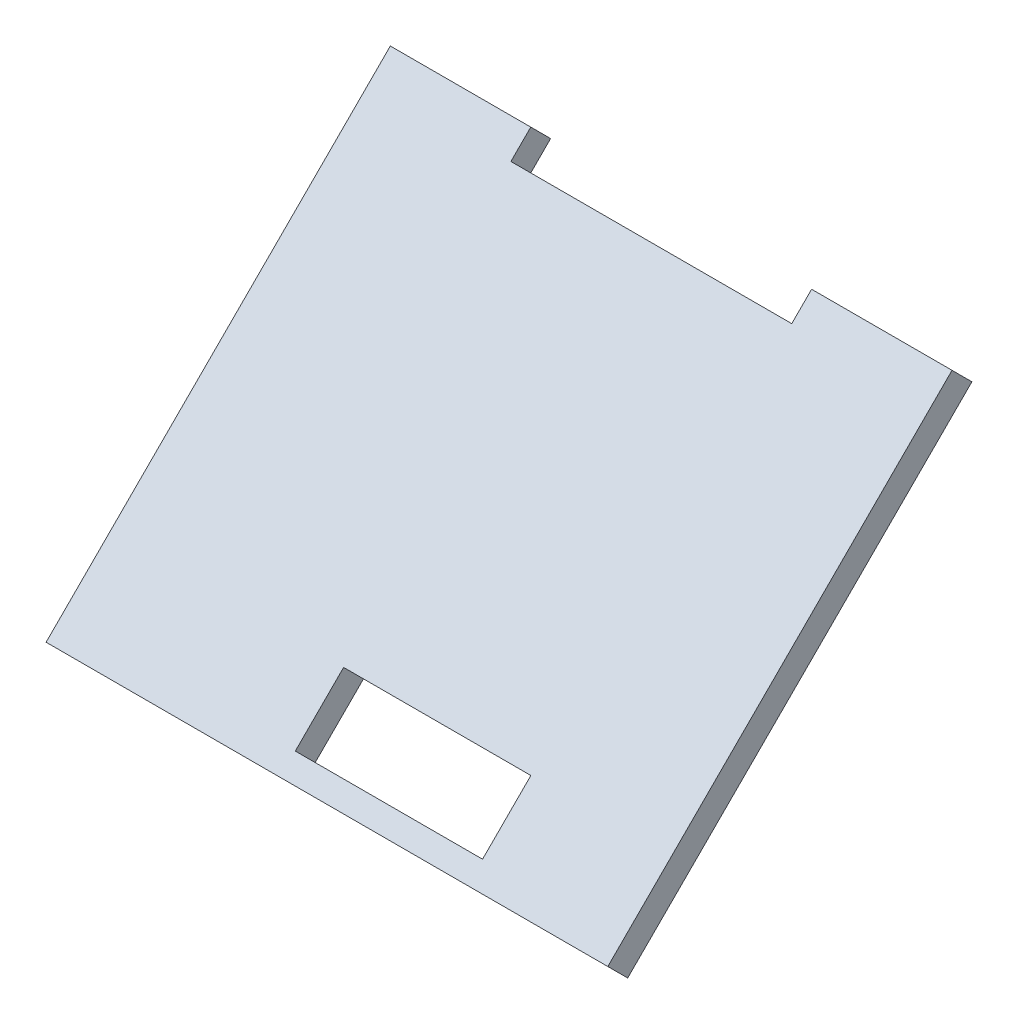
ISO-10303-21;
HEADER;
FILE_DESCRIPTION(('STEP AP214'),'2;1');
FILE_NAME('part.step','',(''),(''),'','','');
FILE_SCHEMA(('AUTOMOTIVE_DESIGN { 1 0 10303 214 1 1 1 1 }'));
ENDSEC;
DATA;
#1=APPLICATION_CONTEXT('core data for automotive mechanical design processes');
#2=APPLICATION_PROTOCOL_DEFINITION('international standard','automotive_design',2000,#1);
#3=PRODUCT_CONTEXT('',#1,'mechanical');
#4=PRODUCT('Part','Part','',(#3));
#5=PRODUCT_RELATED_PRODUCT_CATEGORY('part','',(#4));
#6=PRODUCT_DEFINITION_FORMATION('','',#4);
#7=PRODUCT_DEFINITION_CONTEXT('part definition',#1,'design');
#8=PRODUCT_DEFINITION('design','',#6,#7);
#9=PRODUCT_DEFINITION_SHAPE('','',#8);
#10=(LENGTH_UNIT() NAMED_UNIT(*) SI_UNIT(.MILLI.,.METRE.));
#11=(NAMED_UNIT(*) PLANE_ANGLE_UNIT() SI_UNIT($,.RADIAN.));
#12=(NAMED_UNIT(*) SI_UNIT($,.STERADIAN.) SOLID_ANGLE_UNIT());
#13=UNCERTAINTY_MEASURE_WITH_UNIT(LENGTH_MEASURE(1.E-05),#10,'distance_accuracy_value','');
#14=(GEOMETRIC_REPRESENTATION_CONTEXT(3) GLOBAL_UNCERTAINTY_ASSIGNED_CONTEXT((#13)) GLOBAL_UNIT_ASSIGNED_CONTEXT((#10,
#11,#12)) REPRESENTATION_CONTEXT('',''));
#15=CARTESIAN_POINT('',(0.,0.,0.));
#16=DIRECTION('',(0.,0.,1.));
#17=DIRECTION('',(1.,0.,0.));
#18=AXIS2_PLACEMENT_3D('',#15,#16,#17);
#19=CARTESIAN_POINT('',(0.,72.1213203435599,72.1213203435597));
#20=DIRECTION('',(0.,0.707106781186549,0.707106781186546));
#21=DIRECTION('',(0.,-0.707106781186546,0.707106781186549));
#22=AXIS2_PLACEMENT_3D('',#19,#20,#21);
#23=PLANE('',#22);
#24=DIRECTION('',(0.,-0.707106781186546,0.707106781186549));
#25=VECTOR('',#24,1.);
#26=CARTESIAN_POINT('',(-60.,177.27132034356,-33.0286796564405));
#27=LINE('',#26,#25);
#28=CARTESIAN_POINT('',(-60.,177.27132034356,-33.0286796564405));
#29=VERTEX_POINT('',#28);
#30=CARTESIAN_POINT('',(-60.,140.501767721859,3.74087296526005));
#31=VERTEX_POINT('',#30);
#32=EDGE_CURVE('E160',#29,#31,#27,.T.);
#33=ORIENTED_EDGE('',*,*,#32,.T.);
#34=DIRECTION('',(1.,0.,0.));
#35=VECTOR('',#34,1.);
#36=CARTESIAN_POINT('',(-60.,140.501767721859,3.74087296526005));
#37=LINE('',#36,#35);
#38=CARTESIAN_POINT('',(0.,140.501767721859,3.74087296526005));
#39=VERTEX_POINT('',#38);
#40=EDGE_CURVE('E163',#31,#39,#37,.T.);
#41=ORIENTED_EDGE('',*,*,#40,.T.);
#42=DIRECTION('',(0.,0.707106781186546,-0.707106781186549));
#43=VECTOR('',#42,1.);
#44=CARTESIAN_POINT('',(0.,177.27132034356,-33.0286796564405));
#45=LINE('',#44,#43);
#46=CARTESIAN_POINT('',(0.,177.27132034356,-33.0286796564405));
#47=VERTEX_POINT('',#46);
#48=EDGE_CURVE('E166',#39,#47,#45,.T.);
#49=ORIENTED_EDGE('',*,*,#48,.T.);
#50=DIRECTION('',(-1.,0.,0.));
#51=VECTOR('',#50,1.);
#52=CARTESIAN_POINT('',(-15.,177.27132034356,-33.0286796564405));
#53=LINE('',#52,#51);
#54=CARTESIAN_POINT('',(-15.,177.27132034356,-33.0286796564405));
#55=VERTEX_POINT('',#54);
#56=EDGE_CURVE('E168',#47,#55,#53,.T.);
#57=ORIENTED_EDGE('',*,*,#56,.T.);
#58=DIRECTION('',(0.,-0.707106781186545,0.70710678118655));
#59=VECTOR('',#58,1.);
#60=CARTESIAN_POINT('',(-15.,177.27132034356,-33.0286796564405));
#61=LINE('',#60,#59);
#62=CARTESIAN_POINT('',(-15.,175.15,-30.9073593128808));
#63=VERTEX_POINT('',#62);
#64=EDGE_CURVE('E170',#55,#63,#61,.T.);
#65=ORIENTED_EDGE('',*,*,#64,.T.);
#66=DIRECTION('',(-1.,0.,0.));
#67=VECTOR('',#66,1.);
#68=CARTESIAN_POINT('',(-45.,175.15,-30.9073593128808));
#69=LINE('',#68,#67);
#70=CARTESIAN_POINT('',(-45.,175.15,-30.9073593128808));
#71=VERTEX_POINT('',#70);
#72=EDGE_CURVE('E172',#63,#71,#69,.T.);
#73=ORIENTED_EDGE('',*,*,#72,.T.);
#74=DIRECTION('',(0.,0.707106781186545,-0.70710678118655));
#75=VECTOR('',#74,1.);
#76=CARTESIAN_POINT('',(-45.,177.27132034356,-33.0286796564405));
#77=LINE('',#76,#75);
#78=CARTESIAN_POINT('',(-45.,177.27132034356,-33.0286796564405));
#79=VERTEX_POINT('',#78);
#80=EDGE_CURVE('E174',#71,#79,#77,.T.);
#81=ORIENTED_EDGE('',*,*,#80,.T.);
#82=DIRECTION('',(-1.,0.,0.));
#83=VECTOR('',#82,1.);
#84=CARTESIAN_POINT('',(-60.,177.27132034356,-33.0286796564405));
#85=LINE('',#84,#83);
#86=EDGE_CURVE('E176',#79,#29,#85,.T.);
#87=ORIENTED_EDGE('',*,*,#86,.T.);
#88=EDGE_LOOP('',(#33,#41,#49,#57,#65,#73,#81,#87));
#89=FACE_BOUND('',#88,.T.);
#90=DIRECTION('',(1.,0.,0.));
#91=VECTOR('',#90,1.);
#92=CARTESIAN_POINT('',(-35.,142.12132034356,2.12132034355963));
#93=LINE('',#92,#91);
#94=CARTESIAN_POINT('',(-35.,142.12132034356,2.12132034355963));
#95=VERTEX_POINT('',#94);
#96=CARTESIAN_POINT('',(-15.,142.12132034356,2.12132034355963));
#97=VERTEX_POINT('',#96);
#98=EDGE_CURVE('E132',#95,#97,#93,.T.);
#99=ORIENTED_EDGE('',*,*,#98,.F.);
#100=DIRECTION('',(0.,-0.707106781186546,0.707106781186549));
#101=VECTOR('',#100,1.);
#102=CARTESIAN_POINT('',(-35.,142.12132034356,2.12132034355963));
#103=LINE('',#102,#101);
#104=CARTESIAN_POINT('',(-35.,147.283199846221,-3.04055915910218));
#105=VERTEX_POINT('',#104);
#106=EDGE_CURVE('E124',#105,#95,#103,.T.);
#107=ORIENTED_EDGE('',*,*,#106,.F.);
#108=DIRECTION('',(-1.,0.,0.));
#109=VECTOR('',#108,1.);
#110=CARTESIAN_POINT('',(-35.,147.283199846221,-3.04055915910218));
#111=LINE('',#110,#109);
#112=CARTESIAN_POINT('',(-15.,147.283199846221,-3.04055915910217));
#113=VERTEX_POINT('',#112);
#114=EDGE_CURVE('E146',#113,#105,#111,.T.);
#115=ORIENTED_EDGE('',*,*,#114,.F.);
#116=DIRECTION('',(0.,0.707106781186546,-0.707106781186549));
#117=VECTOR('',#116,1.);
#118=CARTESIAN_POINT('',(-15.,142.12132034356,2.12132034355963));
#119=LINE('',#118,#117);
#120=EDGE_CURVE('E144',#97,#113,#119,.T.);
#121=ORIENTED_EDGE('',*,*,#120,.F.);
#122=EDGE_LOOP('',(#99,#107,#115,#121));
#123=FACE_BOUND('',#122,.T.);
#124=ADVANCED_FACE('F35',(#89,#123),#23,.T.);
#125=CARTESIAN_POINT('',(0.,70.0000000000003,70.));
#126=DIRECTION('',(0.,0.707106781186549,0.707106781186546));
#127=DIRECTION('',(0.,-0.707106781186546,0.707106781186549));
#128=AXIS2_PLACEMENT_3D('',#125,#126,#127);
#129=PLANE('',#128);
#130=DIRECTION('',(0.,-0.707106781186546,0.707106781186549));
#131=VECTOR('',#130,1.);
#132=CARTESIAN_POINT('',(-60.,175.15,-35.1500000000001));
#133=LINE('',#132,#131);
#134=CARTESIAN_POINT('',(-60.,175.15,-35.1500000000001));
#135=VERTEX_POINT('',#134);
#136=CARTESIAN_POINT('',(-60.,138.3804473783,1.61955262170041));
#137=VERTEX_POINT('',#136);
#138=EDGE_CURVE('E140',#135,#137,#133,.T.);
#139=ORIENTED_EDGE('',*,*,#138,.F.);
#140=DIRECTION('',(-1.,0.,0.));
#141=VECTOR('',#140,1.);
#142=CARTESIAN_POINT('',(-60.,175.15,-35.1500000000001));
#143=LINE('',#142,#141);
#144=CARTESIAN_POINT('',(-45.,175.15,-35.1500000000001));
#145=VERTEX_POINT('',#144);
#146=EDGE_CURVE('E164',#145,#135,#143,.T.);
#147=ORIENTED_EDGE('',*,*,#146,.F.);
#148=DIRECTION('',(0.,0.707106781186545,-0.70710678118655));
#149=VECTOR('',#148,1.);
#150=CARTESIAN_POINT('',(-45.,175.15,-35.1500000000001));
#151=LINE('',#150,#149);
#152=CARTESIAN_POINT('',(-45.,173.02867965644,-33.0286796564405));
#153=VERTEX_POINT('',#152);
#154=EDGE_CURVE('E191',#153,#145,#151,.T.);
#155=ORIENTED_EDGE('',*,*,#154,.F.);
#156=DIRECTION('',(-1.,0.,0.));
#157=VECTOR('',#156,1.);
#158=CARTESIAN_POINT('',(-45.,173.02867965644,-33.0286796564405));
#159=LINE('',#158,#157);
#160=CARTESIAN_POINT('',(-15.,173.02867965644,-33.0286796564405));
#161=VERTEX_POINT('',#160);
#162=EDGE_CURVE('E189',#161,#153,#159,.T.);
#163=ORIENTED_EDGE('',*,*,#162,.F.);
#164=DIRECTION('',(0.,-0.707106781186545,0.70710678118655));
#165=VECTOR('',#164,1.);
#166=CARTESIAN_POINT('',(-15.,175.15,-35.1500000000001));
#167=LINE('',#166,#165);
#168=CARTESIAN_POINT('',(-15.,175.15,-35.1500000000001));
#169=VERTEX_POINT('',#168);
#170=EDGE_CURVE('E187',#169,#161,#167,.T.);
#171=ORIENTED_EDGE('',*,*,#170,.F.);
#172=DIRECTION('',(-1.,0.,0.));
#173=VECTOR('',#172,1.);
#174=CARTESIAN_POINT('',(-15.,175.15,-35.1500000000001));
#175=LINE('',#174,#173);
#176=CARTESIAN_POINT('',(0.,175.15,-35.1500000000001));
#177=VERTEX_POINT('',#176);
#178=EDGE_CURVE('E185',#177,#169,#175,.T.);
#179=ORIENTED_EDGE('',*,*,#178,.F.);
#180=DIRECTION('',(0.,0.707106781186546,-0.707106781186549));
#181=VECTOR('',#180,1.);
#182=CARTESIAN_POINT('',(0.,175.15,-35.1500000000001));
#183=LINE('',#182,#181);
#184=CARTESIAN_POINT('',(0.,138.3804473783,1.61955262170041));
#185=VERTEX_POINT('',#184);
#186=EDGE_CURVE('E183',#185,#177,#183,.T.);
#187=ORIENTED_EDGE('',*,*,#186,.F.);
#188=DIRECTION('',(1.,0.,0.));
#189=VECTOR('',#188,1.);
#190=CARTESIAN_POINT('',(-60.,138.3804473783,1.61955262170041));
#191=LINE('',#190,#189);
#192=EDGE_CURVE('E181',#137,#185,#191,.T.);
#193=ORIENTED_EDGE('',*,*,#192,.F.);
#194=EDGE_LOOP('',(#139,#147,#155,#163,#171,#179,#187,#193));
#195=FACE_BOUND('',#194,.T.);
#196=DIRECTION('',(0.,-0.707106781186546,0.707106781186549));
#197=VECTOR('',#196,1.);
#198=CARTESIAN_POINT('',(-35.,140.,0.));
#199=LINE('',#198,#197);
#200=CARTESIAN_POINT('',(-35.,145.161879502662,-5.16187950266181));
#201=VERTEX_POINT('',#200);
#202=CARTESIAN_POINT('',(-35.,140.,0.));
#203=VERTEX_POINT('',#202);
#204=EDGE_CURVE('E58',#201,#203,#199,.T.);
#205=ORIENTED_EDGE('',*,*,#204,.T.);
#206=DIRECTION('',(1.,0.,0.));
#207=VECTOR('',#206,1.);
#208=CARTESIAN_POINT('',(-35.,140.,0.));
#209=LINE('',#208,#207);
#210=CARTESIAN_POINT('',(-15.,140.,0.));
#211=VERTEX_POINT('',#210);
#212=EDGE_CURVE('E139',#203,#211,#209,.T.);
#213=ORIENTED_EDGE('',*,*,#212,.T.);
#214=DIRECTION('',(0.,0.707106781186546,-0.707106781186549));
#215=VECTOR('',#214,1.);
#216=CARTESIAN_POINT('',(-15.,140.,0.));
#217=LINE('',#216,#215);
#218=CARTESIAN_POINT('',(-15.,145.161879502662,-5.16187950266182));
#219=VERTEX_POINT('',#218);
#220=EDGE_CURVE('E152',#211,#219,#217,.T.);
#221=ORIENTED_EDGE('',*,*,#220,.T.);
#222=DIRECTION('',(-1.,0.,0.));
#223=VECTOR('',#222,1.);
#224=CARTESIAN_POINT('',(-35.,145.161879502662,-5.16187950266182));
#225=LINE('',#224,#223);
#226=EDGE_CURVE('E133',#219,#201,#225,.T.);
#227=ORIENTED_EDGE('',*,*,#226,.T.);
#228=EDGE_LOOP('',(#205,#213,#221,#227));
#229=FACE_BOUND('',#228,.T.);
#230=ADVANCED_FACE('F221',(#195,#229),#129,.F.);
#231=CARTESIAN_POINT('',(-60.,177.27132034356,-33.0286796564405));
#232=DIRECTION('',(1.,0.,0.));
#233=DIRECTION('',(0.,0.,-1.));
#234=AXIS2_PLACEMENT_3D('',#231,#232,#233);
#235=PLANE('',#234);
#236=ORIENTED_EDGE('',*,*,#138,.T.);
#237=DIRECTION('',(0.,-0.707106781186549,-0.707106781186546));
#238=VECTOR('',#237,1.);
#239=CARTESIAN_POINT('',(-60.,140.501767721859,3.74087296526005));
#240=LINE('',#239,#238);
#241=EDGE_CURVE('E11',#31,#137,#240,.T.);
#242=ORIENTED_EDGE('',*,*,#241,.F.);
#243=ORIENTED_EDGE('',*,*,#32,.F.);
#244=DIRECTION('',(0.,-0.707106781186549,-0.707106781186546));
#245=VECTOR('',#244,1.);
#246=CARTESIAN_POINT('',(-60.,177.27132034356,-33.0286796564405));
#247=LINE('',#246,#245);
#248=EDGE_CURVE('E178',#29,#135,#247,.T.);
#249=ORIENTED_EDGE('',*,*,#248,.T.);
#250=EDGE_LOOP('',(#236,#242,#243,#249));
#251=FACE_BOUND('',#250,.T.);
#252=ADVANCED_FACE('F37',(#251),#235,.F.);
#253=CARTESIAN_POINT('',(-60.,140.501767721859,3.74087296526005));
#254=DIRECTION('',(0.,0.707106781186546,-0.707106781186549));
#255=DIRECTION('',(0.,0.707106781186549,0.707106781186546));
#256=AXIS2_PLACEMENT_3D('',#253,#254,#255);
#257=PLANE('',#256);
#258=ORIENTED_EDGE('',*,*,#192,.T.);
#259=DIRECTION('',(0.,-0.707106781186549,-0.707106781186546));
#260=VECTOR('',#259,1.);
#261=CARTESIAN_POINT('',(0.,140.501767721859,3.74087296526005));
#262=LINE('',#261,#260);
#263=EDGE_CURVE('E43',#39,#185,#262,.T.);
#264=ORIENTED_EDGE('',*,*,#263,.F.);
#265=ORIENTED_EDGE('',*,*,#40,.F.);
#266=ORIENTED_EDGE('',*,*,#241,.T.);
#267=EDGE_LOOP('',(#258,#264,#265,#266));
#268=FACE_BOUND('',#267,.T.);
#269=ADVANCED_FACE('F238',(#268),#257,.F.);
#270=CARTESIAN_POINT('',(0.,177.27132034356,-33.0286796564405));
#271=DIRECTION('',(-1.,0.,0.));
#272=DIRECTION('',(0.,0.,1.));
#273=AXIS2_PLACEMENT_3D('',#270,#271,#272);
#274=PLANE('',#273);
#275=ORIENTED_EDGE('',*,*,#186,.T.);
#276=DIRECTION('',(0.,-0.707106781186549,-0.707106781186546));
#277=VECTOR('',#276,1.);
#278=CARTESIAN_POINT('',(0.,177.27132034356,-33.0286796564405));
#279=LINE('',#278,#277);
#280=EDGE_CURVE('E208',#47,#177,#279,.T.);
#281=ORIENTED_EDGE('',*,*,#280,.F.);
#282=ORIENTED_EDGE('',*,*,#48,.F.);
#283=ORIENTED_EDGE('',*,*,#263,.T.);
#284=EDGE_LOOP('',(#275,#281,#282,#283));
#285=FACE_BOUND('',#284,.T.);
#286=ADVANCED_FACE('F215',(#285),#274,.F.);
#287=CARTESIAN_POINT('',(-15.,177.27132034356,-33.0286796564405));
#288=DIRECTION('',(0.,-0.707106781186546,0.707106781186549));
#289=DIRECTION('',(0.,-0.707106781186549,-0.707106781186546));
#290=AXIS2_PLACEMENT_3D('',#287,#288,#289);
#291=PLANE('',#290);
#292=ORIENTED_EDGE('',*,*,#178,.T.);
#293=DIRECTION('',(0.,-0.707106781186549,-0.707106781186546));
#294=VECTOR('',#293,1.);
#295=CARTESIAN_POINT('',(-15.,177.27132034356,-33.0286796564405));
#296=LINE('',#295,#294);
#297=EDGE_CURVE('E205',#55,#169,#296,.T.);
#298=ORIENTED_EDGE('',*,*,#297,.F.);
#299=ORIENTED_EDGE('',*,*,#56,.F.);
#300=ORIENTED_EDGE('',*,*,#280,.T.);
#301=EDGE_LOOP('',(#292,#298,#299,#300));
#302=FACE_BOUND('',#301,.T.);
#303=ADVANCED_FACE('F227',(#302),#291,.F.);
#304=CARTESIAN_POINT('',(-15.,177.27132034356,-33.0286796564405));
#305=DIRECTION('',(1.,0.,0.));
#306=DIRECTION('',(0.,0.,-1.));
#307=AXIS2_PLACEMENT_3D('',#304,#305,#306);
#308=PLANE('',#307);
#309=ORIENTED_EDGE('',*,*,#170,.T.);
#310=DIRECTION('',(0.,-0.707106781186549,-0.707106781186546));
#311=VECTOR('',#310,1.);
#312=CARTESIAN_POINT('',(-15.,175.15,-30.9073593128808));
#313=LINE('',#312,#311);
#314=EDGE_CURVE('E202',#63,#161,#313,.T.);
#315=ORIENTED_EDGE('',*,*,#314,.F.);
#316=ORIENTED_EDGE('',*,*,#64,.F.);
#317=ORIENTED_EDGE('',*,*,#297,.T.);
#318=EDGE_LOOP('',(#309,#315,#316,#317));
#319=FACE_BOUND('',#318,.T.);
#320=ADVANCED_FACE('F231',(#319),#308,.F.);
#321=CARTESIAN_POINT('',(-45.,175.15,-30.9073593128808));
#322=DIRECTION('',(0.,-0.707106781186546,0.707106781186549));
#323=DIRECTION('',(0.,-0.707106781186549,-0.707106781186546));
#324=AXIS2_PLACEMENT_3D('',#321,#322,#323);
#325=PLANE('',#324);
#326=ORIENTED_EDGE('',*,*,#162,.T.);
#327=DIRECTION('',(0.,-0.707106781186549,-0.707106781186546));
#328=VECTOR('',#327,1.);
#329=CARTESIAN_POINT('',(-45.,175.15,-30.9073593128808));
#330=LINE('',#329,#328);
#331=EDGE_CURVE('E199',#71,#153,#330,.T.);
#332=ORIENTED_EDGE('',*,*,#331,.F.);
#333=ORIENTED_EDGE('',*,*,#72,.F.);
#334=ORIENTED_EDGE('',*,*,#314,.T.);
#335=EDGE_LOOP('',(#326,#332,#333,#334));
#336=FACE_BOUND('',#335,.T.);
#337=ADVANCED_FACE('F251',(#336),#325,.F.);
#338=CARTESIAN_POINT('',(-45.,177.27132034356,-33.0286796564405));
#339=DIRECTION('',(-1.,0.,0.));
#340=DIRECTION('',(0.,0.,1.));
#341=AXIS2_PLACEMENT_3D('',#338,#339,#340);
#342=PLANE('',#341);
#343=ORIENTED_EDGE('',*,*,#154,.T.);
#344=DIRECTION('',(0.,-0.707106781186549,-0.707106781186546));
#345=VECTOR('',#344,1.);
#346=CARTESIAN_POINT('',(-45.,177.27132034356,-33.0286796564405));
#347=LINE('',#346,#345);
#348=EDGE_CURVE('E196',#79,#145,#347,.T.);
#349=ORIENTED_EDGE('',*,*,#348,.F.);
#350=ORIENTED_EDGE('',*,*,#80,.F.);
#351=ORIENTED_EDGE('',*,*,#331,.T.);
#352=EDGE_LOOP('',(#343,#349,#350,#351));
#353=FACE_BOUND('',#352,.T.);
#354=ADVANCED_FACE('F249',(#353),#342,.F.);
#355=CARTESIAN_POINT('',(-60.,177.27132034356,-33.0286796564405));
#356=DIRECTION('',(0.,-0.707106781186546,0.707106781186549));
#357=DIRECTION('',(0.,-0.707106781186549,-0.707106781186546));
#358=AXIS2_PLACEMENT_3D('',#355,#356,#357);
#359=PLANE('',#358);
#360=ORIENTED_EDGE('',*,*,#146,.T.);
#361=ORIENTED_EDGE('',*,*,#248,.F.);
#362=ORIENTED_EDGE('',*,*,#86,.F.);
#363=ORIENTED_EDGE('',*,*,#348,.T.);
#364=EDGE_LOOP('',(#360,#361,#362,#363));
#365=FACE_BOUND('',#364,.T.);
#366=ADVANCED_FACE('F244',(#365),#359,.F.);
#367=CARTESIAN_POINT('',(-35.,142.12132034356,2.12132034355963));
#368=DIRECTION('',(1.,0.,0.));
#369=DIRECTION('',(0.,0.,-1.));
#370=AXIS2_PLACEMENT_3D('',#367,#368,#369);
#371=PLANE('',#370);
#372=ORIENTED_EDGE('',*,*,#204,.F.);
#373=DIRECTION('',(0.,-0.707106781186549,-0.707106781186546));
#374=VECTOR('',#373,1.);
#375=CARTESIAN_POINT('',(-35.,147.283199846221,-3.04055915910218));
#376=LINE('',#375,#374);
#377=EDGE_CURVE('E128',#105,#201,#376,.T.);
#378=ORIENTED_EDGE('',*,*,#377,.F.);
#379=ORIENTED_EDGE('',*,*,#106,.T.);
#380=DIRECTION('',(0.,-0.707106781186549,-0.707106781186546));
#381=VECTOR('',#380,1.);
#382=CARTESIAN_POINT('',(-35.,142.12132034356,2.12132034355963));
#383=LINE('',#382,#381);
#384=EDGE_CURVE('E127',#95,#203,#383,.T.);
#385=ORIENTED_EDGE('',*,*,#384,.T.);
#386=EDGE_LOOP('',(#372,#378,#379,#385));
#387=FACE_BOUND('',#386,.T.);
#388=ADVANCED_FACE('F126',(#387),#371,.T.);
#389=CARTESIAN_POINT('',(-35.,142.12132034356,2.12132034355963));
#390=DIRECTION('',(0.,0.707106781186546,-0.707106781186549));
#391=DIRECTION('',(0.,0.707106781186549,0.707106781186546));
#392=AXIS2_PLACEMENT_3D('',#389,#390,#391);
#393=PLANE('',#392);
#394=ORIENTED_EDGE('',*,*,#212,.F.);
#395=ORIENTED_EDGE('',*,*,#384,.F.);
#396=ORIENTED_EDGE('',*,*,#98,.T.);
#397=DIRECTION('',(0.,-0.707106781186549,-0.707106781186546));
#398=VECTOR('',#397,1.);
#399=CARTESIAN_POINT('',(-15.,142.12132034356,2.12132034355963));
#400=LINE('',#399,#398);
#401=EDGE_CURVE('E141',#97,#211,#400,.T.);
#402=ORIENTED_EDGE('',*,*,#401,.T.);
#403=EDGE_LOOP('',(#394,#395,#396,#402));
#404=FACE_BOUND('',#403,.T.);
#405=ADVANCED_FACE('F136',(#404),#393,.T.);
#406=CARTESIAN_POINT('',(-15.,142.12132034356,2.12132034355963));
#407=DIRECTION('',(-1.,0.,0.));
#408=DIRECTION('',(0.,0.,1.));
#409=AXIS2_PLACEMENT_3D('',#406,#407,#408);
#410=PLANE('',#409);
#411=ORIENTED_EDGE('',*,*,#220,.F.);
#412=ORIENTED_EDGE('',*,*,#401,.F.);
#413=ORIENTED_EDGE('',*,*,#120,.T.);
#414=DIRECTION('',(0.,-0.707106781186549,-0.707106781186546));
#415=VECTOR('',#414,1.);
#416=CARTESIAN_POINT('',(-15.,147.283199846221,-3.04055915910218));
#417=LINE('',#416,#415);
#418=EDGE_CURVE('E50',#113,#219,#417,.T.);
#419=ORIENTED_EDGE('',*,*,#418,.T.);
#420=EDGE_LOOP('',(#411,#412,#413,#419));
#421=FACE_BOUND('',#420,.T.);
#422=ADVANCED_FACE('F276',(#421),#410,.T.);
#423=CARTESIAN_POINT('',(-35.,147.283199846221,-3.04055915910218));
#424=DIRECTION('',(0.,-0.707106781186546,0.707106781186549));
#425=DIRECTION('',(0.,-0.707106781186549,-0.707106781186546));
#426=AXIS2_PLACEMENT_3D('',#423,#424,#425);
#427=PLANE('',#426);
#428=ORIENTED_EDGE('',*,*,#226,.F.);
#429=ORIENTED_EDGE('',*,*,#418,.F.);
#430=ORIENTED_EDGE('',*,*,#114,.T.);
#431=ORIENTED_EDGE('',*,*,#377,.T.);
#432=EDGE_LOOP('',(#428,#429,#430,#431));
#433=FACE_BOUND('',#432,.T.);
#434=ADVANCED_FACE('F280',(#433),#427,.T.);
#435=CLOSED_SHELL('',(#124,#230,#252,#269,#286,#303,#320,#337,#354,#366,#388,#405,#422,#434));
#436=MANIFOLD_SOLID_BREP('B2',#435);
#437=ADVANCED_BREP_SHAPE_REPRESENTATION('',(#18,#436),#14);
#438=SHAPE_DEFINITION_REPRESENTATION(#9,#437);
ENDSEC;
END-ISO-10303-21;
